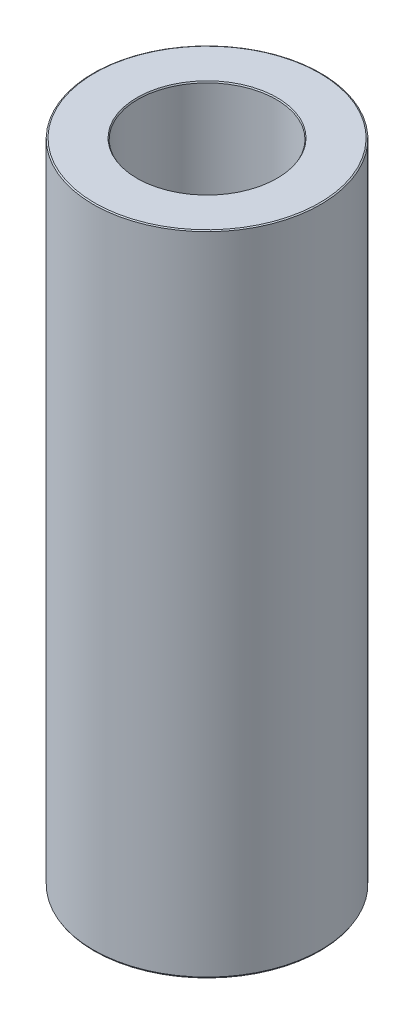
ISO-10303-21;
HEADER;
FILE_DESCRIPTION(('STEP AP214'),'2;1');
FILE_NAME('part.step','',(''),(''),'','','');
FILE_SCHEMA(('AUTOMOTIVE_DESIGN { 1 0 10303 214 1 1 1 1 }'));
ENDSEC;
DATA;
#1=APPLICATION_CONTEXT('core data for automotive mechanical design processes');
#2=APPLICATION_PROTOCOL_DEFINITION('international standard','automotive_design',2000,#1);
#3=PRODUCT_CONTEXT('',#1,'mechanical');
#4=PRODUCT('Part','Part','',(#3));
#5=PRODUCT_RELATED_PRODUCT_CATEGORY('part','',(#4));
#6=PRODUCT_DEFINITION_FORMATION('','',#4);
#7=PRODUCT_DEFINITION_CONTEXT('part definition',#1,'design');
#8=PRODUCT_DEFINITION('design','',#6,#7);
#9=PRODUCT_DEFINITION_SHAPE('','',#8);
#10=(LENGTH_UNIT() NAMED_UNIT(*) SI_UNIT(.MILLI.,.METRE.));
#11=(NAMED_UNIT(*) PLANE_ANGLE_UNIT() SI_UNIT($,.RADIAN.));
#12=(NAMED_UNIT(*) SI_UNIT($,.STERADIAN.) SOLID_ANGLE_UNIT());
#13=UNCERTAINTY_MEASURE_WITH_UNIT(LENGTH_MEASURE(1.E-05),#10,'distance_accuracy_value','');
#14=(GEOMETRIC_REPRESENTATION_CONTEXT(3) GLOBAL_UNCERTAINTY_ASSIGNED_CONTEXT((#13)) GLOBAL_UNIT_ASSIGNED_CONTEXT((#10,
#11,#12)) REPRESENTATION_CONTEXT('',''));
#15=CARTESIAN_POINT('',(0.,0.,0.));
#16=DIRECTION('',(0.,0.,1.));
#17=DIRECTION('',(1.,0.,0.));
#18=AXIS2_PLACEMENT_3D('',#15,#16,#17);
#19=CARTESIAN_POINT('',(0.,256.197425094576,0.));
#20=DIRECTION('',(0.,-1.,0.));
#21=DIRECTION('',(0.,0.,-1.));
#22=AXIS2_PLACEMENT_3D('',#19,#20,#21);
#23=CYLINDRICAL_SURFACE('',#22,45.);
#24=CARTESIAN_POINT('',(0.,0.503289805544316,0.));
#25=DIRECTION('',(0.,1.,0.));
#26=DIRECTION('',(0.,0.,1.));
#27=AXIS2_PLACEMENT_3D('',#24,#25,#26);
#28=CIRCLE('',#27,45.);
#29=CARTESIAN_POINT('',(0.,0.503289805544316,45.));
#30=VERTEX_POINT('',#29);
#31=EDGE_CURVE('E10',#30,#30,#28,.T.);
#32=ORIENTED_EDGE('',*,*,#31,.T.);
#33=EDGE_LOOP('',(#32));
#34=FACE_BOUND('',#33,.T.);
#35=CARTESIAN_POINT('',(0.,255.906850589865,0.));
#36=DIRECTION('',(0.,1.,0.));
#37=DIRECTION('',(0.,0.,1.));
#38=AXIS2_PLACEMENT_3D('',#35,#36,#37);
#39=CIRCLE('',#38,45.);
#40=CARTESIAN_POINT('',(0.,255.906850589865,45.));
#41=VERTEX_POINT('',#40);
#42=EDGE_CURVE('E50',#41,#41,#39,.F.);
#43=ORIENTED_EDGE('',*,*,#42,.T.);
#44=EDGE_LOOP('',(#43));
#45=FACE_BOUND('',#44,.T.);
#46=ADVANCED_FACE('F39',(#34,#45),#23,.T.);
#47=CARTESIAN_POINT('',(0.,256.197425094576,0.));
#48=DIRECTION('',(0.,1.,0.));
#49=DIRECTION('',(0.,0.,1.));
#50=AXIS2_PLACEMENT_3D('',#47,#48,#49);
#51=PLANE('',#50);
#52=CARTESIAN_POINT('',(0.,256.197425094576,0.));
#53=DIRECTION('',(0.,1.,0.));
#54=DIRECTION('',(0.,0.,1.));
#55=AXIS2_PLACEMENT_3D('',#52,#53,#54);
#56=CIRCLE('',#55,27.7022618252898);
#57=CARTESIAN_POINT('',(0.,256.197425094576,27.7022618252898));
#58=VERTEX_POINT('',#57);
#59=EDGE_CURVE('E58',#58,#58,#56,.F.);
#60=ORIENTED_EDGE('',*,*,#59,.T.);
#61=EDGE_LOOP('',(#60));
#62=FACE_BOUND('',#61,.T.);
#63=CARTESIAN_POINT('',(0.,256.197425094576,0.));
#64=DIRECTION('',(0.,1.,0.));
#65=DIRECTION('',(0.,0.,1.));
#66=AXIS2_PLACEMENT_3D('',#63,#64,#65);
#67=CIRCLE('',#66,44.4967101944557);
#68=CARTESIAN_POINT('',(0.,256.197425094576,44.4967101944557));
#69=VERTEX_POINT('',#68);
#70=EDGE_CURVE('E61',#69,#69,#67,.T.);
#71=ORIENTED_EDGE('',*,*,#70,.T.);
#72=EDGE_LOOP('',(#71));
#73=FACE_BOUND('',#72,.T.);
#74=ADVANCED_FACE('F88',(#62,#73),#51,.T.);
#75=CARTESIAN_POINT('',(0.,0.,0.));
#76=DIRECTION('',(0.,1.,0.));
#77=DIRECTION('',(0.,0.,1.));
#78=AXIS2_PLACEMENT_3D('',#75,#76,#77);
#79=PLANE('',#78);
#80=CARTESIAN_POINT('',(0.,0.,0.));
#81=DIRECTION('',(0.,1.,0.));
#82=DIRECTION('',(0.,0.,1.));
#83=AXIS2_PLACEMENT_3D('',#80,#81,#82);
#84=CIRCLE('',#83,27.9149771261227);
#85=CARTESIAN_POINT('',(0.,0.,27.9149771261227));
#86=VERTEX_POINT('',#85);
#87=EDGE_CURVE('E51',#86,#86,#84,.T.);
#88=ORIENTED_EDGE('',*,*,#87,.T.);
#89=EDGE_LOOP('',(#88));
#90=FACE_BOUND('',#89,.T.);
#91=CARTESIAN_POINT('',(0.,0.,0.));
#92=DIRECTION('',(0.,1.,0.));
#93=DIRECTION('',(0.,0.,1.));
#94=AXIS2_PLACEMENT_3D('',#91,#92,#93);
#95=CIRCLE('',#94,44.7094254952886);
#96=CARTESIAN_POINT('',(0.,0.,44.7094254952886));
#97=VERTEX_POINT('',#96);
#98=EDGE_CURVE('E54',#97,#97,#95,.F.);
#99=ORIENTED_EDGE('',*,*,#98,.T.);
#100=EDGE_LOOP('',(#99));
#101=FACE_BOUND('',#100,.T.);
#102=ADVANCED_FACE('F83',(#90,#101),#79,.F.);
#103=CARTESIAN_POINT('',(0.,256.197425094576,0.));
#104=DIRECTION('',(0.,-1.,0.));
#105=DIRECTION('',(0.,0.,-1.));
#106=AXIS2_PLACEMENT_3D('',#103,#104,#105);
#107=CYLINDRICAL_SURFACE('',#106,27.4116873205785);
#108=CARTESIAN_POINT('',(0.,255.694135289032,0.));
#109=DIRECTION('',(0.,1.,0.));
#110=DIRECTION('',(0.,0.,1.));
#111=AXIS2_PLACEMENT_3D('',#108,#109,#110);
#112=CIRCLE('',#111,27.4116873205785);
#113=CARTESIAN_POINT('',(0.,255.694135289032,27.4116873205785));
#114=VERTEX_POINT('',#113);
#115=EDGE_CURVE('E67',#114,#114,#112,.T.);
#116=ORIENTED_EDGE('',*,*,#115,.T.);
#117=EDGE_LOOP('',(#116));
#118=FACE_BOUND('',#117,.T.);
#119=CARTESIAN_POINT('',(0.,0.290574504711316,0.));
#120=DIRECTION('',(0.,1.,0.));
#121=DIRECTION('',(0.,0.,1.));
#122=AXIS2_PLACEMENT_3D('',#119,#120,#121);
#123=CIRCLE('',#122,27.4116873205785);
#124=CARTESIAN_POINT('',(0.,0.290574504711316,27.4116873205785));
#125=VERTEX_POINT('',#124);
#126=EDGE_CURVE('E69',#125,#125,#123,.F.);
#127=ORIENTED_EDGE('',*,*,#126,.T.);
#128=EDGE_LOOP('',(#127));
#129=FACE_BOUND('',#128,.T.);
#130=ADVANCED_FACE('F71',(#118,#129),#107,.F.);
#131=CARTESIAN_POINT('',(0.,255.694135289032,0.));
#132=DIRECTION('',(0.,1.,0.));
#133=DIRECTION('',(0.,0.,1.));
#134=AXIS2_PLACEMENT_3D('',#131,#132,#133);
#135=CONICAL_SURFACE('',#134,27.4116873205785,0.52359877559824);
#136=ORIENTED_EDGE('',*,*,#59,.F.);
#137=EDGE_LOOP('',(#136));
#138=FACE_BOUND('',#137,.T.);
#139=ORIENTED_EDGE('',*,*,#115,.F.);
#140=EDGE_LOOP('',(#139));
#141=FACE_BOUND('',#140,.T.);
#142=ADVANCED_FACE('F77',(#138,#141),#135,.F.);
#143=CARTESIAN_POINT('',(0.,0.,0.));
#144=DIRECTION('',(0.,-1.,0.));
#145=DIRECTION('',(0.,0.,-1.));
#146=AXIS2_PLACEMENT_3D('',#143,#144,#145);
#147=CONICAL_SURFACE('',#146,27.9149771261227,1.04719755119663);
#148=ORIENTED_EDGE('',*,*,#126,.F.);
#149=EDGE_LOOP('',(#148));
#150=FACE_BOUND('',#149,.T.);
#151=ORIENTED_EDGE('',*,*,#87,.F.);
#152=EDGE_LOOP('',(#151));
#153=FACE_BOUND('',#152,.T.);
#154=ADVANCED_FACE('F73',(#150,#153),#147,.F.);
#155=CARTESIAN_POINT('',(0.,0.503289805544316,0.));
#156=DIRECTION('',(0.,1.,0.));
#157=DIRECTION('',(0.,0.,1.));
#158=AXIS2_PLACEMENT_3D('',#155,#156,#157);
#159=CONICAL_SURFACE('',#158,45.,0.523598775598301);
#160=ORIENTED_EDGE('',*,*,#98,.F.);
#161=EDGE_LOOP('',(#160));
#162=FACE_BOUND('',#161,.T.);
#163=ORIENTED_EDGE('',*,*,#31,.F.);
#164=EDGE_LOOP('',(#163));
#165=FACE_BOUND('',#164,.T.);
#166=ADVANCED_FACE('F76',(#162,#165),#159,.T.);
#167=CARTESIAN_POINT('',(0.,256.197425094576,0.));
#168=DIRECTION('',(0.,-1.,0.));
#169=DIRECTION('',(0.,0.,-1.));
#170=AXIS2_PLACEMENT_3D('',#167,#168,#169);
#171=CONICAL_SURFACE('',#170,44.4967101944557,1.04719755119654);
#172=ORIENTED_EDGE('',*,*,#42,.F.);
#173=EDGE_LOOP('',(#172));
#174=FACE_BOUND('',#173,.T.);
#175=ORIENTED_EDGE('',*,*,#70,.F.);
#176=EDGE_LOOP('',(#175));
#177=FACE_BOUND('',#176,.T.);
#178=ADVANCED_FACE('F45',(#174,#177),#171,.T.);
#179=CLOSED_SHELL('',(#46,#74,#102,#130,#142,#154,#166,#178));
#180=MANIFOLD_SOLID_BREP('B2',#179);
#181=ADVANCED_BREP_SHAPE_REPRESENTATION('',(#18,#180),#14);
#182=SHAPE_DEFINITION_REPRESENTATION(#9,#181);
ENDSEC;
END-ISO-10303-21;
